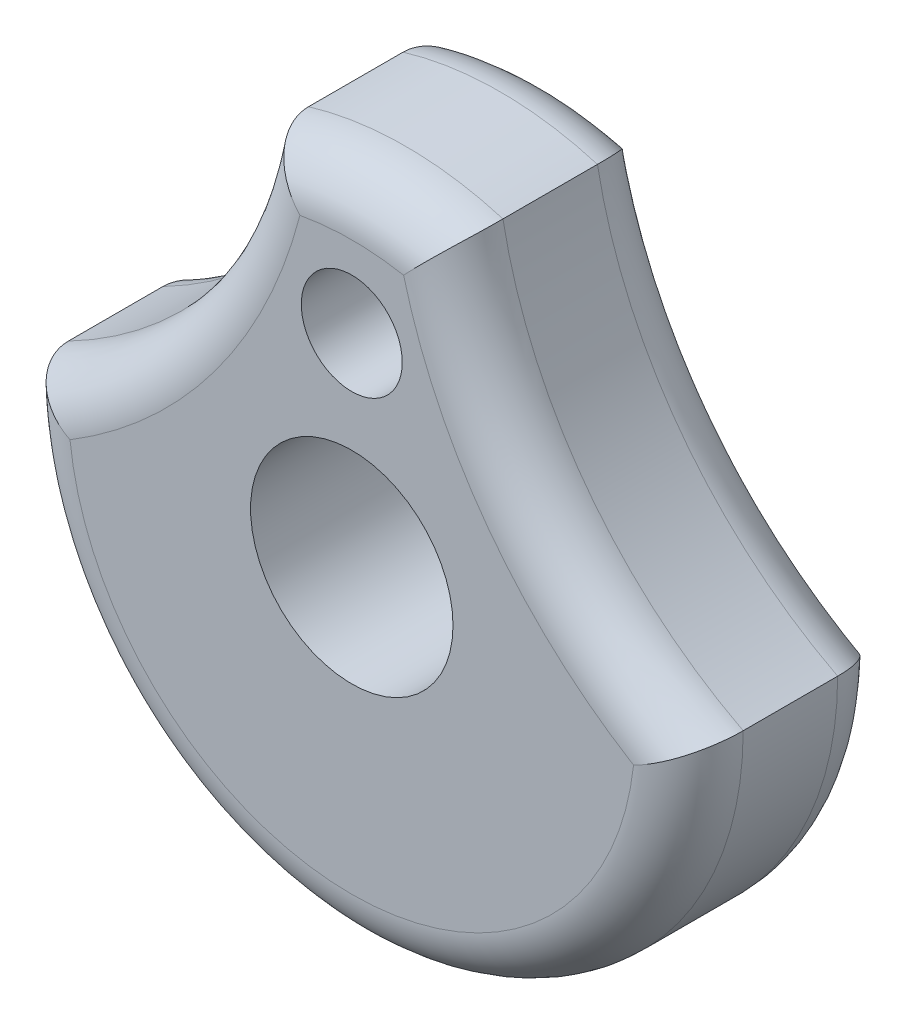
ISO-10303-21;
HEADER;
FILE_DESCRIPTION(('STEP AP214'),'2;1');
FILE_NAME('part.step','',(''),(''),'','','');
FILE_SCHEMA(('AUTOMOTIVE_DESIGN { 1 0 10303 214 1 1 1 1 }'));
ENDSEC;
DATA;
#1=APPLICATION_CONTEXT('core data for automotive mechanical design processes');
#2=APPLICATION_PROTOCOL_DEFINITION('international standard','automotive_design',2000,#1);
#3=PRODUCT_CONTEXT('',#1,'mechanical');
#4=PRODUCT('Part','Part','',(#3));
#5=PRODUCT_RELATED_PRODUCT_CATEGORY('part','',(#4));
#6=PRODUCT_DEFINITION_FORMATION('','',#4);
#7=PRODUCT_DEFINITION_CONTEXT('part definition',#1,'design');
#8=PRODUCT_DEFINITION('design','',#6,#7);
#9=PRODUCT_DEFINITION_SHAPE('','',#8);
#10=(LENGTH_UNIT() NAMED_UNIT(*) SI_UNIT(.MILLI.,.METRE.));
#11=(NAMED_UNIT(*) PLANE_ANGLE_UNIT() SI_UNIT($,.RADIAN.));
#12=(NAMED_UNIT(*) SI_UNIT($,.STERADIAN.) SOLID_ANGLE_UNIT());
#13=UNCERTAINTY_MEASURE_WITH_UNIT(LENGTH_MEASURE(1.E-05),#10,'distance_accuracy_value','');
#14=(GEOMETRIC_REPRESENTATION_CONTEXT(3) GLOBAL_UNCERTAINTY_ASSIGNED_CONTEXT((#13)) GLOBAL_UNIT_ASSIGNED_CONTEXT((#10,
#11,#12)) REPRESENTATION_CONTEXT('',''));
#15=CARTESIAN_POINT('',(0.,0.,0.));
#16=DIRECTION('',(0.,0.,1.));
#17=DIRECTION('',(1.,0.,0.));
#18=AXIS2_PLACEMENT_3D('',#15,#16,#17);
#19=CARTESIAN_POINT('',(25.7938097586221,19.1766867047533,9.525));
#20=DIRECTION('',(0.,0.,-1.));
#21=DIRECTION('',(-1.,0.,0.));
#22=AXIS2_PLACEMENT_3D('',#19,#20,#21);
#23=CYLINDRICAL_SURFACE('',#22,21.59);
#24=DIRECTION('',(0.,0.,-1.));
#25=VECTOR('',#24,1.);
#26=CARTESIAN_POINT('',(15.875,0.,9.525));
#27=LINE('',#26,#25);
#28=CARTESIAN_POINT('',(15.875,0.,6.985));
#29=VERTEX_POINT('',#28);
#30=CARTESIAN_POINT('',(15.875,0.,2.54));
#31=VERTEX_POINT('',#30);
#32=EDGE_CURVE('E106',#29,#31,#27,.T.);
#33=ORIENTED_EDGE('',*,*,#32,.T.);
#34=CARTESIAN_POINT('',(25.7938097586221,19.1766867047533,2.54));
#35=DIRECTION('',(0.,0.,1.));
#36=DIRECTION('',(1.,0.,0.));
#37=AXIS2_PLACEMENT_3D('',#34,#35,#36);
#38=CIRCLE('',#37,21.59);
#39=CARTESIAN_POINT('',(4.57280398990691,15.2021409238926,2.54));
#40=VERTEX_POINT('',#39);
#41=EDGE_CURVE('E113',#31,#40,#38,.F.);
#42=ORIENTED_EDGE('',*,*,#41,.T.);
#43=DIRECTION('',(0.,0.,-1.));
#44=VECTOR('',#43,1.);
#45=CARTESIAN_POINT('',(4.57280398990691,15.2021409238926,9.525));
#46=LINE('',#45,#44);
#47=CARTESIAN_POINT('',(4.57280398990691,15.2021409238926,6.985));
#48=VERTEX_POINT('',#47);
#49=EDGE_CURVE('E108',#48,#40,#46,.T.);
#50=ORIENTED_EDGE('',*,*,#49,.F.);
#51=CARTESIAN_POINT('',(25.7938097586221,19.1766867047533,6.985));
#52=DIRECTION('',(0.,0.,1.));
#53=DIRECTION('',(1.,0.,0.));
#54=AXIS2_PLACEMENT_3D('',#51,#52,#53);
#55=CIRCLE('',#54,21.59);
#56=EDGE_CURVE('E104',#48,#29,#55,.T.);
#57=ORIENTED_EDGE('',*,*,#56,.T.);
#58=EDGE_LOOP('',(#33,#42,#50,#57));
#59=FACE_BOUND('',#58,.T.);
#60=ADVANCED_FACE('F33',(#59),#23,.F.);
#61=CARTESIAN_POINT('',(0.,0.,9.525));
#62=DIRECTION('',(0.,0.,-1.));
#63=DIRECTION('',(-1.,0.,0.));
#64=AXIS2_PLACEMENT_3D('',#61,#62,#63);
#65=CYLINDRICAL_SURFACE('',#64,15.875);
#66=ORIENTED_EDGE('',*,*,#49,.T.);
#67=CARTESIAN_POINT('',(0.,0.,2.54));
#68=DIRECTION('',(0.,0.,1.));
#69=DIRECTION('',(1.,0.,0.));
#70=AXIS2_PLACEMENT_3D('',#67,#68,#69);
#71=CIRCLE('',#70,15.875);
#72=CARTESIAN_POINT('',(-4.57280398990701,15.2021409238926,2.54));
#73=VERTEX_POINT('',#72);
#74=EDGE_CURVE('E251',#40,#73,#71,.T.);
#75=ORIENTED_EDGE('',*,*,#74,.T.);
#76=DIRECTION('',(0.,0.,-1.));
#77=VECTOR('',#76,1.);
#78=CARTESIAN_POINT('',(-4.57280398990701,15.2021409238926,9.525));
#79=LINE('',#78,#77);
#80=CARTESIAN_POINT('',(-4.57280398990701,15.2021409238926,6.985));
#81=VERTEX_POINT('',#80);
#82=EDGE_CURVE('E235',#81,#73,#79,.T.);
#83=ORIENTED_EDGE('',*,*,#82,.F.);
#84=CARTESIAN_POINT('',(0.,0.,6.985));
#85=DIRECTION('',(0.,0.,1.));
#86=DIRECTION('',(1.,0.,0.));
#87=AXIS2_PLACEMENT_3D('',#84,#85,#86);
#88=CIRCLE('',#87,15.875);
#89=EDGE_CURVE('E249',#81,#48,#88,.F.);
#90=ORIENTED_EDGE('',*,*,#89,.T.);
#91=EDGE_LOOP('',(#66,#75,#83,#90));
#92=FACE_BOUND('',#91,.T.);
#93=ADVANCED_FACE('F266',(#92),#65,.T.);
#94=CARTESIAN_POINT('',(-25.7938097586222,19.1766867047532,9.525));
#95=DIRECTION('',(0.,0.,-1.));
#96=DIRECTION('',(-1.,0.,0.));
#97=AXIS2_PLACEMENT_3D('',#94,#95,#96);
#98=CYLINDRICAL_SURFACE('',#97,21.59);
#99=ORIENTED_EDGE('',*,*,#82,.T.);
#100=CARTESIAN_POINT('',(-25.7938097586222,19.1766867047532,2.54));
#101=DIRECTION('',(0.,0.,1.));
#102=DIRECTION('',(1.,0.,0.));
#103=AXIS2_PLACEMENT_3D('',#100,#101,#102);
#104=CIRCLE('',#103,21.59);
#105=CARTESIAN_POINT('',(-15.875,-1.07552855510562E-13,2.54));
#106=VERTEX_POINT('',#105);
#107=EDGE_CURVE('E114',#73,#106,#104,.F.);
#108=ORIENTED_EDGE('',*,*,#107,.T.);
#109=DIRECTION('',(0.,0.,-1.));
#110=VECTOR('',#109,1.);
#111=CARTESIAN_POINT('',(-15.875,-1.07552855510562E-13,9.525));
#112=LINE('',#111,#110);
#113=CARTESIAN_POINT('',(-15.875,-1.07552855510562E-13,6.985));
#114=VERTEX_POINT('',#113);
#115=EDGE_CURVE('E126',#114,#106,#112,.T.);
#116=ORIENTED_EDGE('',*,*,#115,.F.);
#117=CARTESIAN_POINT('',(-25.7938097586222,19.1766867047532,6.985));
#118=DIRECTION('',(0.,0.,1.));
#119=DIRECTION('',(1.,0.,0.));
#120=AXIS2_PLACEMENT_3D('',#117,#118,#119);
#121=CIRCLE('',#120,21.59);
#122=EDGE_CURVE('E253',#114,#81,#121,.T.);
#123=ORIENTED_EDGE('',*,*,#122,.T.);
#124=EDGE_LOOP('',(#99,#108,#116,#123));
#125=FACE_BOUND('',#124,.T.);
#126=ADVANCED_FACE('F264',(#125),#98,.F.);
#127=CARTESIAN_POINT('',(0.,0.,9.525));
#128=DIRECTION('',(0.,0.,-1.));
#129=DIRECTION('',(-1.,0.,0.));
#130=AXIS2_PLACEMENT_3D('',#127,#128,#129);
#131=CYLINDRICAL_SURFACE('',#130,15.875);
#132=ORIENTED_EDGE('',*,*,#115,.T.);
#133=CARTESIAN_POINT('',(0.,0.,2.54));
#134=DIRECTION('',(0.,0.,1.));
#135=DIRECTION('',(1.,0.,0.));
#136=AXIS2_PLACEMENT_3D('',#133,#134,#135);
#137=CIRCLE('',#136,15.875);
#138=EDGE_CURVE('E125',#106,#31,#137,.T.);
#139=ORIENTED_EDGE('',*,*,#138,.T.);
#140=ORIENTED_EDGE('',*,*,#32,.F.);
#141=CARTESIAN_POINT('',(0.,0.,6.985));
#142=DIRECTION('',(0.,0.,1.));
#143=DIRECTION('',(1.,0.,0.));
#144=AXIS2_PLACEMENT_3D('',#141,#142,#143);
#145=CIRCLE('',#144,15.875);
#146=EDGE_CURVE('E122',#29,#114,#145,.F.);
#147=ORIENTED_EDGE('',*,*,#146,.T.);
#148=EDGE_LOOP('',(#132,#139,#140,#147));
#149=FACE_BOUND('',#148,.T.);
#150=ADVANCED_FACE('F121',(#149),#131,.T.);
#151=CARTESIAN_POINT('',(12.896904879311,9.58834335237667,9.525));
#152=DIRECTION('',(0.,0.,1.));
#153=DIRECTION('',(1.,0.,0.));
#154=AXIS2_PLACEMENT_3D('',#151,#152,#153);
#155=PLANE('',#154);
#156=CARTESIAN_POINT('',(-25.7938097586222,19.1766867047532,9.525));
#157=DIRECTION('',(0.,0.,1.));
#158=DIRECTION('',(1.,0.,0.));
#159=AXIS2_PLACEMENT_3D('',#156,#157,#158);
#160=CIRCLE('',#159,24.13);
#161=CARTESIAN_POINT('',(-2.43887124996943,13.1100774988584,9.525));
#162=VERTEX_POINT('',#161);
#163=CARTESIAN_POINT('',(-13.2569276121907,-1.44086615795313,9.525));
#164=VERTEX_POINT('',#163);
#165=EDGE_CURVE('E47',#162,#164,#160,.F.);
#166=ORIENTED_EDGE('',*,*,#165,.T.);
#167=CARTESIAN_POINT('',(0.,0.,9.525));
#168=DIRECTION('',(0.,0.,1.));
#169=DIRECTION('',(1.,0.,0.));
#170=AXIS2_PLACEMENT_3D('',#167,#168,#169);
#171=CIRCLE('',#170,13.335);
#172=CARTESIAN_POINT('',(13.2569276121908,-1.44086615795303,9.525));
#173=VERTEX_POINT('',#172);
#174=EDGE_CURVE('E11',#164,#173,#171,.T.);
#175=ORIENTED_EDGE('',*,*,#174,.T.);
#176=CARTESIAN_POINT('',(25.7938097586221,19.1766867047533,9.525));
#177=DIRECTION('',(0.,0.,1.));
#178=DIRECTION('',(1.,0.,0.));
#179=AXIS2_PLACEMENT_3D('',#176,#177,#178);
#180=CIRCLE('',#179,24.13);
#181=CARTESIAN_POINT('',(2.43887124996934,13.1100774988584,9.525));
#182=VERTEX_POINT('',#181);
#183=EDGE_CURVE('E138',#173,#182,#180,.F.);
#184=ORIENTED_EDGE('',*,*,#183,.T.);
#185=CARTESIAN_POINT('',(0.,0.,9.525));
#186=DIRECTION('',(0.,0.,1.));
#187=DIRECTION('',(1.,0.,0.));
#188=AXIS2_PLACEMENT_3D('',#185,#186,#187);
#189=CIRCLE('',#188,13.335);
#190=EDGE_CURVE('E58',#182,#162,#189,.T.);
#191=ORIENTED_EDGE('',*,*,#190,.T.);
#192=EDGE_LOOP('',(#166,#175,#184,#191));
#193=FACE_BOUND('',#192,.T.);
#194=CARTESIAN_POINT('',(0.,9.525,9.525));
#195=DIRECTION('',(0.,0.,1.));
#196=DIRECTION('',(1.,0.,0.));
#197=AXIS2_PLACEMENT_3D('',#194,#195,#196);
#198=CIRCLE('',#197,2.3749);
#199=CARTESIAN_POINT('',(2.3749,9.525,9.525));
#200=VERTEX_POINT('',#199);
#201=EDGE_CURVE('E230',#200,#200,#198,.T.);
#202=ORIENTED_EDGE('',*,*,#201,.F.);
#203=EDGE_LOOP('',(#202));
#204=FACE_BOUND('',#203,.T.);
#205=CARTESIAN_POINT('',(0.,0.,9.525));
#206=DIRECTION('',(0.,0.,1.));
#207=DIRECTION('',(1.,0.,0.));
#208=AXIS2_PLACEMENT_3D('',#205,#206,#207);
#209=CIRCLE('',#208,4.7625);
#210=CARTESIAN_POINT('',(4.7625,0.,9.525));
#211=VERTEX_POINT('',#210);
#212=EDGE_CURVE('E220',#211,#211,#209,.T.);
#213=ORIENTED_EDGE('',*,*,#212,.F.);
#214=EDGE_LOOP('',(#213));
#215=FACE_BOUND('',#214,.T.);
#216=ADVANCED_FACE('F258',(#193,#204,#215),#155,.T.);
#217=CARTESIAN_POINT('',(12.896904879311,9.58834335237667,0.));
#218=DIRECTION('',(0.,0.,1.));
#219=DIRECTION('',(1.,0.,0.));
#220=AXIS2_PLACEMENT_3D('',#217,#218,#219);
#221=PLANE('',#220);
#222=CARTESIAN_POINT('',(0.,0.,0.));
#223=DIRECTION('',(0.,0.,1.));
#224=DIRECTION('',(1.,0.,0.));
#225=AXIS2_PLACEMENT_3D('',#222,#223,#224);
#226=CIRCLE('',#225,13.335);
#227=CARTESIAN_POINT('',(13.2569276121908,-1.44086615795303,0.));
#228=VERTEX_POINT('',#227);
#229=CARTESIAN_POINT('',(-13.2569276121907,-1.44086615795313,0.));
#230=VERTEX_POINT('',#229);
#231=EDGE_CURVE('E244',#228,#230,#226,.F.);
#232=ORIENTED_EDGE('',*,*,#231,.T.);
#233=CARTESIAN_POINT('',(-25.7938097586222,19.1766867047532,0.));
#234=DIRECTION('',(0.,0.,1.));
#235=DIRECTION('',(1.,0.,0.));
#236=AXIS2_PLACEMENT_3D('',#233,#234,#235);
#237=CIRCLE('',#236,24.13);
#238=CARTESIAN_POINT('',(-2.43887124996943,13.1100774988584,0.));
#239=VERTEX_POINT('',#238);
#240=EDGE_CURVE('E247',#230,#239,#237,.T.);
#241=ORIENTED_EDGE('',*,*,#240,.T.);
#242=CARTESIAN_POINT('',(0.,0.,0.));
#243=DIRECTION('',(0.,0.,1.));
#244=DIRECTION('',(1.,0.,0.));
#245=AXIS2_PLACEMENT_3D('',#242,#243,#244);
#246=CIRCLE('',#245,13.335);
#247=CARTESIAN_POINT('',(2.43887124996934,13.1100774988584,0.));
#248=VERTEX_POINT('',#247);
#249=EDGE_CURVE('E242',#239,#248,#246,.F.);
#250=ORIENTED_EDGE('',*,*,#249,.T.);
#251=CARTESIAN_POINT('',(25.7938097586221,19.1766867047533,0.));
#252=DIRECTION('',(0.,0.,1.));
#253=DIRECTION('',(1.,0.,0.));
#254=AXIS2_PLACEMENT_3D('',#251,#252,#253);
#255=CIRCLE('',#254,24.13);
#256=EDGE_CURVE('E240',#248,#228,#255,.T.);
#257=ORIENTED_EDGE('',*,*,#256,.T.);
#258=EDGE_LOOP('',(#232,#241,#250,#257));
#259=FACE_BOUND('',#258,.T.);
#260=CARTESIAN_POINT('',(0.,9.525,0.));
#261=DIRECTION('',(0.,0.,1.));
#262=DIRECTION('',(1.,0.,0.));
#263=AXIS2_PLACEMENT_3D('',#260,#261,#262);
#264=CIRCLE('',#263,2.3749);
#265=CARTESIAN_POINT('',(2.3749,9.525,0.));
#266=VERTEX_POINT('',#265);
#267=EDGE_CURVE('E127',#266,#266,#264,.T.);
#268=ORIENTED_EDGE('',*,*,#267,.T.);
#269=EDGE_LOOP('',(#268));
#270=FACE_BOUND('',#269,.T.);
#271=CARTESIAN_POINT('',(0.,0.,0.));
#272=DIRECTION('',(0.,0.,1.));
#273=DIRECTION('',(1.,0.,0.));
#274=AXIS2_PLACEMENT_3D('',#271,#272,#273);
#275=CIRCLE('',#274,4.7625);
#276=CARTESIAN_POINT('',(4.7625,0.,0.));
#277=VERTEX_POINT('',#276);
#278=EDGE_CURVE('E225',#277,#277,#275,.T.);
#279=ORIENTED_EDGE('',*,*,#278,.T.);
#280=EDGE_LOOP('',(#279));
#281=FACE_BOUND('',#280,.T.);
#282=ADVANCED_FACE('F271',(#259,#270,#281),#221,.F.);
#283=CARTESIAN_POINT('',(0.,0.,0.));
#284=DIRECTION('',(0.,0.,1.));
#285=DIRECTION('',(1.,0.,0.));
#286=AXIS2_PLACEMENT_3D('',#283,#284,#285);
#287=CYLINDRICAL_SURFACE('',#286,4.7625);
#288=ORIENTED_EDGE('',*,*,#278,.F.);
#289=EDGE_LOOP('',(#288));
#290=FACE_BOUND('',#289,.T.);
#291=ORIENTED_EDGE('',*,*,#212,.T.);
#292=EDGE_LOOP('',(#291));
#293=FACE_BOUND('',#292,.T.);
#294=ADVANCED_FACE('F274',(#290,#293),#287,.F.);
#295=CARTESIAN_POINT('',(0.,9.525,0.));
#296=DIRECTION('',(0.,0.,1.));
#297=DIRECTION('',(1.,0.,0.));
#298=AXIS2_PLACEMENT_3D('',#295,#296,#297);
#299=CYLINDRICAL_SURFACE('',#298,2.3749);
#300=ORIENTED_EDGE('',*,*,#267,.F.);
#301=EDGE_LOOP('',(#300));
#302=FACE_BOUND('',#301,.T.);
#303=ORIENTED_EDGE('',*,*,#201,.T.);
#304=EDGE_LOOP('',(#303));
#305=FACE_BOUND('',#304,.T.);
#306=ADVANCED_FACE('F208',(#302,#305),#299,.F.);
#307=CARTESIAN_POINT('',(0.,0.,2.54));
#308=DIRECTION('',(0.,0.,1.));
#309=DIRECTION('',(1.,0.,0.));
#310=AXIS2_PLACEMENT_3D('',#307,#308,#309);
#311=TOROIDAL_SURFACE('',#310,13.335,2.54);
#312=CARTESIAN_POINT('',(4.57280398990691,15.2021409238926,2.54));
#313=CARTESIAN_POINT('',(4.57281465136094,15.2021486057288,2.47603560373069));
#314=CARTESIAN_POINT('',(4.57070007438932,15.200250924341,2.41207772575404));
#315=CARTESIAN_POINT('',(4.56230180506382,15.1927040803601,2.28468082454548));
#316=CARTESIAN_POINT('',(4.55601957925863,15.1870562374059,2.22124162674244));
#317=CARTESIAN_POINT('',(4.53940430037611,15.1721015698677,2.0956222109934));
#318=CARTESIAN_POINT('',(4.52908938832426,15.162811130959,2.03343764845845));
#319=CARTESIAN_POINT('',(4.50456828913407,15.1406886173148,1.91049720965043));
#320=CARTESIAN_POINT('',(4.49036191797095,15.1278563750894,1.84974140108987));
#321=CARTESIAN_POINT('',(4.44221063601691,15.0842729609395,1.67036373706096));
#322=CARTESIAN_POINT('',(4.40270098681301,15.0484060205812,1.55439204579702));
#323=CARTESIAN_POINT('',(4.31081508657193,14.9644736753747,1.33241582003183));
#324=CARTESIAN_POINT('',(4.25842731713093,14.9163973489687,1.22642032642111));
#325=CARTESIAN_POINT('',(4.139869369725,14.8067730909705,1.02082192167433));
#326=CARTESIAN_POINT('',(4.07310619623515,14.7446363461399,0.92187661223978));
#327=CARTESIAN_POINT('',(3.93033086423794,14.6105272458753,0.738469944524923));
#328=CARTESIAN_POINT('',(3.85431669373897,14.5385527504165,0.654011746692579));
#329=CARTESIAN_POINT('',(3.68450070317218,14.3761129203311,0.489711004648566));
#330=CARTESIAN_POINT('',(3.58968845254214,14.284465136194,0.412083874261919));
#331=CARTESIAN_POINT('',(3.39412329804025,14.0930187376558,0.276749507981646));
#332=CARTESIAN_POINT('',(3.29336327810571,13.9932103023428,0.219066723658445));
#333=CARTESIAN_POINT('',(3.06891031521176,13.7678689913467,0.114560445205774));
#334=CARTESIAN_POINT('',(2.94452623234314,13.6410744136766,0.0719432465750767));
#335=CARTESIAN_POINT('',(2.69502001655887,13.3824112470006,0.0149701721984075));
#336=CARTESIAN_POINT('',(2.56989998218255,13.2505538730292,0.000555133379072757));
#337=CARTESIAN_POINT('',(2.44368646816547,13.1152424078464,5.23499497569894E-06));
#338=CARTESIAN_POINT('',(2.44127860361031,13.1126601117773,-7.25242372987132E-09));
#339=CARTESIAN_POINT('',(2.43887124996934,13.1100774988584,0.));
#340=B_SPLINE_CURVE_WITH_KNOTS('',3,(#312,#313,#314,#315,#316,#317,#318,#319,#320,#321,#322,
#323,#324,#325,#326,#327,#328,#329,#330,#331,#332,#333,#334,#335,#336,#337,#338,#339),
.UNSPECIFIED.,.F.,.F.,(4,2,2,2,2,2,2,2,2,2,2,2,2,4),(0.,0.191819226210021,0.383570989172034,
0.574469903149903,0.765377846183164,1.14647244678492,1.52790915287631,1.93001433421454,
2.33220712588611,2.7894695085645,3.24729051898375,3.79294232192802,4.33744821261729,
4.34804039996427),.UNSPECIFIED.);
#341=EDGE_CURVE('E180',#248,#40,#340,.F.);
#342=ORIENTED_EDGE('',*,*,#341,.F.);
#343=ORIENTED_EDGE('',*,*,#249,.F.);
#344=CARTESIAN_POINT('',(-4.57280398990701,15.2021409238926,2.54));
#345=CARTESIAN_POINT('',(-4.57281465136105,15.2021486057287,2.47603560373069));
#346=CARTESIAN_POINT('',(-4.57070007438943,15.200250924341,2.41207772575404));
#347=CARTESIAN_POINT('',(-4.56230180506392,15.19270408036,2.28468082454548));
#348=CARTESIAN_POINT('',(-4.55601957925874,15.1870562374059,2.22124162674244));
#349=CARTESIAN_POINT('',(-4.53940430037622,15.1721015698677,2.0956222109934));
#350=CARTESIAN_POINT('',(-4.52908938832436,15.162811130959,2.03343764845845));
#351=CARTESIAN_POINT('',(-4.50456828913418,15.1406886173148,1.91049720965043));
#352=CARTESIAN_POINT('',(-4.49036191797105,15.1278563750894,1.84974140108987));
#353=CARTESIAN_POINT('',(-4.44221063601701,15.0842729609395,1.67036373706096));
#354=CARTESIAN_POINT('',(-4.40270098681312,15.0484060205812,1.55439204579702));
#355=CARTESIAN_POINT('',(-4.31081508657204,14.9644736753747,1.33241582003183));
#356=CARTESIAN_POINT('',(-4.25842731713104,14.9163973489687,1.22642032642111));
#357=CARTESIAN_POINT('',(-4.1398693697251,14.8067730909705,1.02082192167433));
#358=CARTESIAN_POINT('',(-4.07310619623525,14.7446363461399,0.921876612239782));
#359=CARTESIAN_POINT('',(-3.93033086423805,14.6105272458753,0.738469944524924));
#360=CARTESIAN_POINT('',(-3.85431669373908,14.5385527504165,0.654011746692578));
#361=CARTESIAN_POINT('',(-3.68450070317229,14.3761129203311,0.489711004648565));
#362=CARTESIAN_POINT('',(-3.58968845254224,14.284465136194,0.41208387426192));
#363=CARTESIAN_POINT('',(-3.39412329804036,14.0930187376558,0.276749507981647));
#364=CARTESIAN_POINT('',(-3.29336327810582,13.9932103023427,0.219066723658446));
#365=CARTESIAN_POINT('',(-3.06891031521184,13.7678689913467,0.114560445205774));
#366=CARTESIAN_POINT('',(-2.94452623234318,13.6410744136767,0.0719432465750785));
#367=CARTESIAN_POINT('',(-2.69502001655901,13.3824112470005,0.014970172198406));
#368=CARTESIAN_POINT('',(-2.56989998218283,13.250553873029,0.000555133379066718));
#369=CARTESIAN_POINT('',(-2.44368646816557,13.1152424078464,5.23499497546649E-06));
#370=CARTESIAN_POINT('',(-2.44127860361041,13.1126601117773,-7.25242384764804E-09));
#371=CARTESIAN_POINT('',(-2.43887124996943,13.1100774988584,0.));
#372=B_SPLINE_CURVE_WITH_KNOTS('',3,(#344,#345,#346,#347,#348,#349,#350,#351,#352,#353,#354,
#355,#356,#357,#358,#359,#360,#361,#362,#363,#364,#365,#366,#367,#368,#369,#370,#371),
.UNSPECIFIED.,.F.,.F.,(4,2,2,2,2,2,2,2,2,2,2,2,2,4),(0.,0.19181922621002,0.383570989172033,
0.574469903149903,0.765377846183164,1.14647244678492,1.52790915287631,1.93001433421454,
2.3322071258861,2.78946950856449,3.24729051898375,3.79294232192802,4.33744821261729,
4.34804039996427),.UNSPECIFIED.);
#373=EDGE_CURVE('E149',#73,#239,#372,.T.);
#374=ORIENTED_EDGE('',*,*,#373,.F.);
#375=ORIENTED_EDGE('',*,*,#74,.F.);
#376=EDGE_LOOP('',(#342,#343,#374,#375));
#377=FACE_BOUND('',#376,.T.);
#378=ADVANCED_FACE('F203',(#377),#311,.T.);
#379=CARTESIAN_POINT('',(-25.7938097586222,19.1766867047532,2.54));
#380=DIRECTION('',(0.,0.,1.));
#381=DIRECTION('',(1.,0.,0.));
#382=AXIS2_PLACEMENT_3D('',#379,#380,#381);
#383=TOROIDAL_SURFACE('',#382,24.13,2.54);
#384=ORIENTED_EDGE('',*,*,#373,.T.);
#385=ORIENTED_EDGE('',*,*,#240,.F.);
#386=CARTESIAN_POINT('',(-15.875,-1.07552855510562E-13,2.54));
#387=CARTESIAN_POINT('',(-15.8750104272816,7.99681222404428E-06,2.47603560373069));
#388=CARTESIAN_POINT('',(-15.8725840735242,-0.00147032583945496,2.41207772575404));
#389=CARTESIAN_POINT('',(-15.8629379742984,-0.00733876272360966,2.28468082454548));
#390=CARTESIAN_POINT('',(-15.8557199149767,-0.0117278526896572,2.22124162674244));
#391=CARTESIAN_POINT('',(-15.836613056586,-0.0233311942755172,2.0956222109934));
#392=CARTESIAN_POINT('',(-15.8247451742224,-0.0305327936783537,2.03343764845845));
#393=CARTESIAN_POINT('',(-15.79649700098,-0.0476421660776718,1.91049720965043));
#394=CARTESIAN_POINT('',(-15.7801164967018,-0.0575500670534872,1.84974140108987));
#395=CARTESIAN_POINT('',(-15.7245103500504,-0.0911062348527187,1.67036373706096));
#396=CARTESIAN_POINT('',(-15.6787828436973,-0.118609779235394,1.55439204579702));
#397=CARTESIAN_POINT('',(-15.5719401633106,-0.182424345619105,1.33241582003183));
#398=CARTESIAN_POINT('',(-15.5108112127437,-0.218743251856638,1.22642032642111));
#399=CARTESIAN_POINT('',(-15.3716826663689,-0.300698803336808,1.02082192167433));
#400=CARTESIAN_POINT('',(-15.2929484013246,-0.346733702060464,0.921876612239786));
#401=CARTESIAN_POINT('',(-15.1233969651534,-0.444827313947327,0.738469944524927));
#402=CARTESIAN_POINT('',(-15.032577165151,-0.496887337388739,0.65401174669258));
#403=CARTESIAN_POINT('',(-14.8281067130046,-0.61271480930009,0.489711004648563));
#404=CARTESIAN_POINT('',(-14.7130326740888,-0.677109256066802,0.412083874261916));
#405=CARTESIAN_POINT('',(-14.4733680284988,-0.809239157386553,0.276749507981645));
#406=CARTESIAN_POINT('',(-14.3487659673836,-0.876978597469197,0.219066723658445));
#407=CARTESIAN_POINT('',(-14.0683218873834,-1.02700845111888,0.114560445205778));
#408=CARTESIAN_POINT('',(-13.911072560231,-1.1095972766808,0.0719432465750833));
#409=CARTESIAN_POINT('',(-13.5915023598731,-1.27402012349064,0.014970172198408));
#410=CARTESIAN_POINT('',(-13.4291928308405,-1.3558553656434,0.000555133379067746));
#411=CARTESIAN_POINT('',(-13.2632606341292,-1.43774278729673,5.23499497550744E-06));
#412=CARTESIAN_POINT('',(-13.2600942012855,-1.43930476288892,-7.25242382560634E-09));
#413=CARTESIAN_POINT('',(-13.2569276121907,-1.44086615795312,0.));
#414=B_SPLINE_CURVE_WITH_KNOTS('',3,(#386,#387,#388,#389,#390,#391,#392,#393,#394,#395,#396,
#397,#398,#399,#400,#401,#402,#403,#404,#405,#406,#407,#408,#409,#410,#411,#412,#413),
.UNSPECIFIED.,.F.,.F.,(4,2,2,2,2,2,2,2,2,2,2,2,2,4),(0.,0.19181922621002,0.383570989172033,
0.574469903149902,0.765377846183162,1.14647244678492,1.52790915287631,1.93001433421453,
2.3322071258861,2.7894695085645,3.24729051898375,3.79294232192799,4.33744821261729,
4.34804039996426),.UNSPECIFIED.);
#415=EDGE_CURVE('E174',#106,#230,#414,.T.);
#416=ORIENTED_EDGE('',*,*,#415,.F.);
#417=ORIENTED_EDGE('',*,*,#107,.F.);
#418=EDGE_LOOP('',(#384,#385,#416,#417));
#419=FACE_BOUND('',#418,.T.);
#420=ADVANCED_FACE('F199',(#419),#383,.T.);
#421=CARTESIAN_POINT('',(25.7938097586221,19.1766867047533,2.54));
#422=DIRECTION('',(0.,0.,1.));
#423=DIRECTION('',(1.,0.,0.));
#424=AXIS2_PLACEMENT_3D('',#421,#422,#423);
#425=TOROIDAL_SURFACE('',#424,24.13,2.54);
#426=ORIENTED_EDGE('',*,*,#341,.T.);
#427=ORIENTED_EDGE('',*,*,#41,.F.);
#428=CARTESIAN_POINT('',(15.875,0.,2.54));
#429=CARTESIAN_POINT('',(15.8750104272816,7.99681233248233E-06,2.47603560373069));
#430=CARTESIAN_POINT('',(15.8725840735242,-0.00147032583934482,2.41207772575404));
#431=CARTESIAN_POINT('',(15.8629379742984,-0.00733876272349799,2.28468082454548));
#432=CARTESIAN_POINT('',(15.8557199149767,-0.0117278526895457,2.22124162674244));
#433=CARTESIAN_POINT('',(15.836613056586,-0.0233311942754083,2.0956222109934));
#434=CARTESIAN_POINT('',(15.8247451742224,-0.0305327936782472,2.03343764845845));
#435=CARTESIAN_POINT('',(15.79649700098,-0.0476421660775657,1.91049720965043));
#436=CARTESIAN_POINT('',(15.7801164967018,-0.0575500670533789,1.84974140108987));
#437=CARTESIAN_POINT('',(15.7245103500504,-0.0911062348526076,1.67036373706095));
#438=CARTESIAN_POINT('',(15.6787828436973,-0.118609779235286,1.55439204579702));
#439=CARTESIAN_POINT('',(15.5719401633106,-0.182424345619001,1.33241582003183));
#440=CARTESIAN_POINT('',(15.5108112127437,-0.218743251856536,1.22642032642111));
#441=CARTESIAN_POINT('',(15.3716826663689,-0.300698803336707,1.02082192167433));
#442=CARTESIAN_POINT('',(15.2929484013246,-0.346733702060362,0.921876612239785));
#443=CARTESIAN_POINT('',(15.1233969651534,-0.444827313947224,0.738469944524926));
#444=CARTESIAN_POINT('',(15.032577165151,-0.496887337388636,0.654011746692579));
#445=CARTESIAN_POINT('',(14.8281067130046,-0.612714809299991,0.489711004648561));
#446=CARTESIAN_POINT('',(14.7130326740888,-0.677109256066707,0.412083874261915));
#447=CARTESIAN_POINT('',(14.4733680284988,-0.809239157386452,0.276749507981643));
#448=CARTESIAN_POINT('',(14.3487659673836,-0.876978597469086,0.219066723658444));
#449=CARTESIAN_POINT('',(14.0683218873835,-1.0270084511188,0.114560445205777));
#450=CARTESIAN_POINT('',(13.911072560231,-1.10959727668076,0.0719432465750832));
#451=CARTESIAN_POINT('',(13.591502359873,-1.27402012349048,0.0149701721984075));
#452=CARTESIAN_POINT('',(13.4291928308404,-1.35585536564308,0.000555133379066476));
#453=CARTESIAN_POINT('',(13.2632606341292,-1.43774278729663,5.23499497545716E-06));
#454=CARTESIAN_POINT('',(13.2600942012855,-1.43930476288882,-7.25242385184002E-09));
#455=CARTESIAN_POINT('',(13.2569276121908,-1.44086615795303,0.));
#456=B_SPLINE_CURVE_WITH_KNOTS('',3,(#428,#429,#430,#431,#432,#433,#434,#435,#436,#437,#438,
#439,#440,#441,#442,#443,#444,#445,#446,#447,#448,#449,#450,#451,#452,#453,#454,#455),
.UNSPECIFIED.,.F.,.F.,(4,2,2,2,2,2,2,2,2,2,2,2,2,4),(0.,0.191819226210021,0.383570989172034,
0.574469903149903,0.765377846183163,1.14647244678492,1.52790915287631,1.93001433421454,
2.3322071258861,2.78946950856451,3.24729051898375,3.79294232192799,4.3374482126173,
4.34804039996427),.UNSPECIFIED.);
#457=EDGE_CURVE('E172',#228,#31,#456,.F.);
#458=ORIENTED_EDGE('',*,*,#457,.F.);
#459=ORIENTED_EDGE('',*,*,#256,.F.);
#460=EDGE_LOOP('',(#426,#427,#458,#459));
#461=FACE_BOUND('',#460,.T.);
#462=ADVANCED_FACE('F193',(#461),#425,.T.);
#463=CARTESIAN_POINT('',(0.,0.,2.54));
#464=DIRECTION('',(0.,0.,1.));
#465=DIRECTION('',(1.,0.,0.));
#466=AXIS2_PLACEMENT_3D('',#463,#464,#465);
#467=TOROIDAL_SURFACE('',#466,13.335,2.54);
#468=ORIENTED_EDGE('',*,*,#415,.T.);
#469=ORIENTED_EDGE('',*,*,#231,.F.);
#470=ORIENTED_EDGE('',*,*,#457,.T.);
#471=ORIENTED_EDGE('',*,*,#138,.F.);
#472=EDGE_LOOP('',(#468,#469,#470,#471));
#473=FACE_BOUND('',#472,.T.);
#474=ADVANCED_FACE('F196',(#473),#467,.T.);
#475=CARTESIAN_POINT('',(0.,0.,6.985));
#476=DIRECTION('',(0.,0.,1.));
#477=DIRECTION('',(1.,0.,0.));
#478=AXIS2_PLACEMENT_3D('',#475,#476,#477);
#479=TOROIDAL_SURFACE('',#478,13.335,2.54);
#480=CARTESIAN_POINT('',(4.57280398990691,15.2021409238926,6.985));
#481=CARTESIAN_POINT('',(4.57281465136094,15.2021486057288,7.04896439626931));
#482=CARTESIAN_POINT('',(4.57070007438932,15.200250924341,7.11292227424596));
#483=CARTESIAN_POINT('',(4.56230180506382,15.1927040803601,7.24031917545452));
#484=CARTESIAN_POINT('',(4.55601957925863,15.1870562374059,7.30375837325756));
#485=CARTESIAN_POINT('',(4.53940430037611,15.1721015698677,7.4293777890066));
#486=CARTESIAN_POINT('',(4.52908938832426,15.162811130959,7.49156235154155));
#487=CARTESIAN_POINT('',(4.50456828913407,15.1406886173148,7.61450279034957));
#488=CARTESIAN_POINT('',(4.49036191797095,15.1278563750894,7.67525859891013));
#489=CARTESIAN_POINT('',(4.44221063601691,15.0842729609395,7.85463626293904));
#490=CARTESIAN_POINT('',(4.40270098681301,15.0484060205812,7.97060795420298));
#491=CARTESIAN_POINT('',(4.31081508657193,14.9644736753747,8.19258417996816));
#492=CARTESIAN_POINT('',(4.25842731713093,14.9163973489687,8.29857967357889));
#493=CARTESIAN_POINT('',(4.139869369725,14.8067730909705,8.50417807832567));
#494=CARTESIAN_POINT('',(4.07310619623515,14.7446363461399,8.60312338776022));
#495=CARTESIAN_POINT('',(3.93033086423795,14.6105272458753,8.78653005547507));
#496=CARTESIAN_POINT('',(3.85431669373898,14.5385527504165,8.87098825330742));
#497=CARTESIAN_POINT('',(3.68450070317218,14.3761129203311,9.03528899535144));
#498=CARTESIAN_POINT('',(3.58968845254212,14.284465136194,9.11291612573809));
#499=CARTESIAN_POINT('',(3.39412329804027,14.0930187376558,9.24825049201836));
#500=CARTESIAN_POINT('',(3.29336327810579,13.9932103023427,9.30593327634155));
#501=CARTESIAN_POINT('',(3.06891031521166,13.7678689913468,9.41043955479422));
#502=CARTESIAN_POINT('',(2.94452623234274,13.641074413677,9.45305675342491));
#503=CARTESIAN_POINT('',(2.69502001655929,13.3824112470002,9.51002982780159));
#504=CARTESIAN_POINT('',(2.56989998218407,13.2505538730277,9.52444486662094));
#505=CARTESIAN_POINT('',(2.44368646816553,13.1152424078463,9.52499476500502));
#506=CARTESIAN_POINT('',(2.44127860361034,13.1126601117773,9.52500000725242));
#507=CARTESIAN_POINT('',(2.43887124996934,13.1100774988584,9.525));
#508=B_SPLINE_CURVE_WITH_KNOTS('',3,(#480,#481,#482,#483,#484,#485,#486,#487,#488,#489,#490,
#491,#492,#493,#494,#495,#496,#497,#498,#499,#500,#501,#502,#503,#504,#505,#506,#507),
.UNSPECIFIED.,.F.,.F.,(4,2,2,2,2,2,2,2,2,2,2,2,2,4),(0.,0.191819226210021,0.383570989172034,
0.574469903149903,0.765377846183163,1.14647244678492,1.52790915287631,1.93001433421454,
2.3322071258861,2.78946950856451,3.24729051898375,3.79294232192799,4.33744821261729,
4.34804039996427),.UNSPECIFIED.);
#509=EDGE_CURVE('E140',#48,#182,#508,.T.);
#510=ORIENTED_EDGE('',*,*,#509,.F.);
#511=ORIENTED_EDGE('',*,*,#89,.F.);
#512=CARTESIAN_POINT('',(-4.57280398990701,15.2021409238926,6.985));
#513=CARTESIAN_POINT('',(-4.57281465136105,15.2021486057287,7.04896439626931));
#514=CARTESIAN_POINT('',(-4.57070007438943,15.200250924341,7.11292227424596));
#515=CARTESIAN_POINT('',(-4.56230180506392,15.19270408036,7.24031917545452));
#516=CARTESIAN_POINT('',(-4.55601957925874,15.1870562374059,7.30375837325756));
#517=CARTESIAN_POINT('',(-4.53940430037622,15.1721015698677,7.4293777890066));
#518=CARTESIAN_POINT('',(-4.52908938832436,15.162811130959,7.49156235154155));
#519=CARTESIAN_POINT('',(-4.50456828913418,15.1406886173148,7.61450279034957));
#520=CARTESIAN_POINT('',(-4.49036191797105,15.1278563750894,7.67525859891013));
#521=CARTESIAN_POINT('',(-4.44221063601701,15.0842729609395,7.85463626293904));
#522=CARTESIAN_POINT('',(-4.40270098681312,15.0484060205812,7.97060795420298));
#523=CARTESIAN_POINT('',(-4.31081508657203,14.9644736753747,8.19258417996817));
#524=CARTESIAN_POINT('',(-4.25842731713104,14.9163973489687,8.29857967357889));
#525=CARTESIAN_POINT('',(-4.1398693697251,14.8067730909705,8.50417807832567));
#526=CARTESIAN_POINT('',(-4.07310619623525,14.7446363461399,8.60312338776022));
#527=CARTESIAN_POINT('',(-3.93033086423805,14.6105272458753,8.78653005547507));
#528=CARTESIAN_POINT('',(-3.85431669373909,14.5385527504165,8.87098825330742));
#529=CARTESIAN_POINT('',(-3.68450070317228,14.3761129203311,9.03528899535144));
#530=CARTESIAN_POINT('',(-3.58968845254221,14.284465136194,9.11291612573809));
#531=CARTESIAN_POINT('',(-3.39412329804037,14.0930187376558,9.24825049201836));
#532=CARTESIAN_POINT('',(-3.2933632781059,13.9932103023427,9.30593327634156));
#533=CARTESIAN_POINT('',(-3.06891031521175,13.7678689913468,9.41043955479422));
#534=CARTESIAN_POINT('',(-2.94452623234279,13.6410744136771,9.45305675342491));
#535=CARTESIAN_POINT('',(-2.69502001655944,13.3824112470002,9.51002982780159));
#536=CARTESIAN_POINT('',(-2.56989998218436,13.2505538730275,9.52444486662094));
#537=CARTESIAN_POINT('',(-2.44368646816563,13.1152424078463,9.52499476500502));
#538=CARTESIAN_POINT('',(-2.44127860361044,13.1126601117773,9.52500000725242));
#539=CARTESIAN_POINT('',(-2.43887124996943,13.1100774988584,9.525));
#540=B_SPLINE_CURVE_WITH_KNOTS('',3,(#512,#513,#514,#515,#516,#517,#518,#519,#520,#521,#522,
#523,#524,#525,#526,#527,#528,#529,#530,#531,#532,#533,#534,#535,#536,#537,#538,#539),
.UNSPECIFIED.,.F.,.F.,(4,2,2,2,2,2,2,2,2,2,2,2,2,4),(0.,0.191819226210021,0.383570989172033,
0.5744699031499,0.765377846183163,1.14647244678492,1.52790915287631,1.93001433421454,
2.3322071258861,2.78946950856451,3.24729051898375,3.79294232192799,4.3374482126173,
4.34804039996427),.UNSPECIFIED.);
#541=EDGE_CURVE('E38',#162,#81,#540,.F.);
#542=ORIENTED_EDGE('',*,*,#541,.F.);
#543=ORIENTED_EDGE('',*,*,#190,.F.);
#544=EDGE_LOOP('',(#510,#511,#542,#543));
#545=FACE_BOUND('',#544,.T.);
#546=ADVANCED_FACE('F35',(#545),#479,.T.);
#547=CARTESIAN_POINT('',(-25.7938097586222,19.1766867047532,6.985));
#548=DIRECTION('',(0.,0.,1.));
#549=DIRECTION('',(1.,0.,0.));
#550=AXIS2_PLACEMENT_3D('',#547,#548,#549);
#551=TOROIDAL_SURFACE('',#550,24.13,2.54);
#552=ORIENTED_EDGE('',*,*,#541,.T.);
#553=ORIENTED_EDGE('',*,*,#122,.F.);
#554=CARTESIAN_POINT('',(-15.875,-1.07552855510562E-13,6.985));
#555=CARTESIAN_POINT('',(-15.8750104272816,7.99681222451106E-06,7.04896439626931));
#556=CARTESIAN_POINT('',(-15.8725840735242,-0.00147032583945448,7.11292227424596));
#557=CARTESIAN_POINT('',(-15.8629379742984,-0.00733876272360946,7.24031917545452));
#558=CARTESIAN_POINT('',(-15.8557199149767,-0.0117278526896572,7.30375837325756));
#559=CARTESIAN_POINT('',(-15.836613056586,-0.0233311942755175,7.4293777890066));
#560=CARTESIAN_POINT('',(-15.8247451742224,-0.030532793678354,7.49156235154155));
#561=CARTESIAN_POINT('',(-15.79649700098,-0.0476421660776722,7.61450279034957));
#562=CARTESIAN_POINT('',(-15.7801164967018,-0.0575500670534876,7.67525859891013));
#563=CARTESIAN_POINT('',(-15.7245103500504,-0.0911062348527181,7.85463626293904));
#564=CARTESIAN_POINT('',(-15.6787828436973,-0.118609779235391,7.97060795420298));
#565=CARTESIAN_POINT('',(-15.5719401633106,-0.182424345619103,8.19258417996816));
#566=CARTESIAN_POINT('',(-15.5108112127437,-0.218743251856639,8.29857967357889));
#567=CARTESIAN_POINT('',(-15.3716826663689,-0.300698803336809,8.50417807832567));
#568=CARTESIAN_POINT('',(-15.2929484013246,-0.346733702060463,8.60312338776021));
#569=CARTESIAN_POINT('',(-15.1233969651534,-0.444827313947324,8.78653005547507));
#570=CARTESIAN_POINT('',(-15.032577165151,-0.496887337388737,8.87098825330742));
#571=CARTESIAN_POINT('',(-14.8281067130046,-0.612714809300091,9.03528899535144));
#572=CARTESIAN_POINT('',(-14.7130326740888,-0.677109256066805,9.11291612573809));
#573=CARTESIAN_POINT('',(-14.4733680284988,-0.80923915738655,9.24825049201836));
#574=CARTESIAN_POINT('',(-14.3487659673836,-0.876978597469185,9.30593327634155));
#575=CARTESIAN_POINT('',(-14.0683218873834,-1.02700845111889,9.41043955479422));
#576=CARTESIAN_POINT('',(-13.911072560231,-1.10959727668084,9.45305675342491));
#577=CARTESIAN_POINT('',(-13.591502359873,-1.27402012349058,9.51002982780159));
#578=CARTESIAN_POINT('',(-13.4291928308404,-1.35585536564321,9.52444486662094));
#579=CARTESIAN_POINT('',(-13.2632606341292,-1.43774278729673,9.52499476500502));
#580=CARTESIAN_POINT('',(-13.2600942012855,-1.43930476288892,9.52500000725242));
#581=CARTESIAN_POINT('',(-13.2569276121907,-1.44086615795313,9.525));
#582=B_SPLINE_CURVE_WITH_KNOTS('',3,(#554,#555,#556,#557,#558,#559,#560,#561,#562,#563,#564,
#565,#566,#567,#568,#569,#570,#571,#572,#573,#574,#575,#576,#577,#578,#579,#580,#581),
.UNSPECIFIED.,.F.,.F.,(4,2,2,2,2,2,2,2,2,2,2,2,2,4),(0.,0.191819226210021,0.383570989172033,
0.574469903149903,0.765377846183162,1.14647244678492,1.5279091528763,1.93001433421453,
2.3322071258861,2.78946950856451,3.24729051898374,3.79294232192799,4.3374482126173,
4.34804039996427),.UNSPECIFIED.);
#583=EDGE_CURVE('E134',#164,#114,#582,.F.);
#584=ORIENTED_EDGE('',*,*,#583,.F.);
#585=ORIENTED_EDGE('',*,*,#165,.F.);
#586=EDGE_LOOP('',(#552,#553,#584,#585));
#587=FACE_BOUND('',#586,.T.);
#588=ADVANCED_FACE('F164',(#587),#551,.T.);
#589=CARTESIAN_POINT('',(25.7938097586221,19.1766867047533,6.985));
#590=DIRECTION('',(0.,0.,1.));
#591=DIRECTION('',(1.,0.,0.));
#592=AXIS2_PLACEMENT_3D('',#589,#590,#591);
#593=TOROIDAL_SURFACE('',#592,24.13,2.54);
#594=ORIENTED_EDGE('',*,*,#509,.T.);
#595=ORIENTED_EDGE('',*,*,#183,.F.);
#596=CARTESIAN_POINT('',(15.875,0.,6.985));
#597=CARTESIAN_POINT('',(15.8750104272816,7.99681233003684E-06,7.04896439626931));
#598=CARTESIAN_POINT('',(15.8725840735242,-0.00147032583934766,7.11292227424596));
#599=CARTESIAN_POINT('',(15.8629379742984,-0.00733876272350007,7.24031917545452));
#600=CARTESIAN_POINT('',(15.8557199149767,-0.0117278526895466,7.30375837325756));
#601=CARTESIAN_POINT('',(15.836613056586,-0.0233311942754079,7.4293777890066));
#602=CARTESIAN_POINT('',(15.8247451742224,-0.0305327936782467,7.49156235154155));
#603=CARTESIAN_POINT('',(15.79649700098,-0.0476421660775651,7.61450279034957));
#604=CARTESIAN_POINT('',(15.7801164967018,-0.0575500670533786,7.67525859891013));
#605=CARTESIAN_POINT('',(15.7245103500504,-0.0911062348526085,7.85463626293904));
#606=CARTESIAN_POINT('',(15.6787828436973,-0.118609779235288,7.97060795420298));
#607=CARTESIAN_POINT('',(15.5719401633106,-0.182424345619002,8.19258417996817));
#608=CARTESIAN_POINT('',(15.5108112127437,-0.218743251856534,8.29857967357889));
#609=CARTESIAN_POINT('',(15.3716826663689,-0.300698803336704,8.50417807832567));
#610=CARTESIAN_POINT('',(15.2929484013246,-0.346733702060361,8.60312338776022));
#611=CARTESIAN_POINT('',(15.1233969651534,-0.444827313947228,8.78653005547507));
#612=CARTESIAN_POINT('',(15.032577165151,-0.496887337388642,8.87098825330742));
#613=CARTESIAN_POINT('',(14.8281067130046,-0.612714809299998,9.03528899535144));
#614=CARTESIAN_POINT('',(14.7130326740888,-0.677109256066711,9.11291612573809));
#615=CARTESIAN_POINT('',(14.4733680284988,-0.809239157386452,9.24825049201836));
#616=CARTESIAN_POINT('',(14.3487659673836,-0.876978597469084,9.30593327634156));
#617=CARTESIAN_POINT('',(14.0683218873835,-1.02700845111881,9.41043955479422));
#618=CARTESIAN_POINT('',(13.911072560231,-1.10959727668079,9.45305675342492));
#619=CARTESIAN_POINT('',(13.591502359873,-1.27402012349045,9.51002982780159));
#620=CARTESIAN_POINT('',(13.4291928308403,-1.35585536564297,9.52444486662094));
#621=CARTESIAN_POINT('',(13.2632606341292,-1.43774278729663,9.52499476500502));
#622=CARTESIAN_POINT('',(13.2600942012855,-1.43930476288883,9.52500000725242));
#623=CARTESIAN_POINT('',(13.2569276121908,-1.44086615795304,9.525));
#624=B_SPLINE_CURVE_WITH_KNOTS('',3,(#596,#597,#598,#599,#600,#601,#602,#603,#604,#605,#606,
#607,#608,#609,#610,#611,#612,#613,#614,#615,#616,#617,#618,#619,#620,#621,#622,#623),
.UNSPECIFIED.,.F.,.F.,(4,2,2,2,2,2,2,2,2,2,2,2,2,4),(0.,0.191819226210021,0.383570989172033,
0.574469903149902,0.765377846183163,1.14647244678492,1.52790915287631,1.93001433421454,
2.3322071258861,2.78946950856451,3.24729051898375,3.79294232192799,4.3374482126173,
4.34804039996427),.UNSPECIFIED.);
#625=EDGE_CURVE('E132',#29,#173,#624,.T.);
#626=ORIENTED_EDGE('',*,*,#625,.F.);
#627=ORIENTED_EDGE('',*,*,#56,.F.);
#628=EDGE_LOOP('',(#594,#595,#626,#627));
#629=FACE_BOUND('',#628,.T.);
#630=ADVANCED_FACE('F137',(#629),#593,.T.);
#631=CARTESIAN_POINT('',(0.,0.,6.985));
#632=DIRECTION('',(0.,0.,1.));
#633=DIRECTION('',(1.,0.,0.));
#634=AXIS2_PLACEMENT_3D('',#631,#632,#633);
#635=TOROIDAL_SURFACE('',#634,13.335,2.54);
#636=ORIENTED_EDGE('',*,*,#583,.T.);
#637=ORIENTED_EDGE('',*,*,#146,.F.);
#638=ORIENTED_EDGE('',*,*,#625,.T.);
#639=ORIENTED_EDGE('',*,*,#174,.F.);
#640=EDGE_LOOP('',(#636,#637,#638,#639));
#641=FACE_BOUND('',#640,.T.);
#642=ADVANCED_FACE('F130',(#641),#635,.T.);
#643=CLOSED_SHELL('',(#60,#93,#126,#150,#216,#282,#294,#306,#378,#420,#462,#474,#546,#588,#630,#642));
#644=MANIFOLD_SOLID_BREP('B2',#643);
#645=ADVANCED_BREP_SHAPE_REPRESENTATION('',(#18,#644),#14);
#646=SHAPE_DEFINITION_REPRESENTATION(#9,#645);
ENDSEC;
END-ISO-10303-21;
